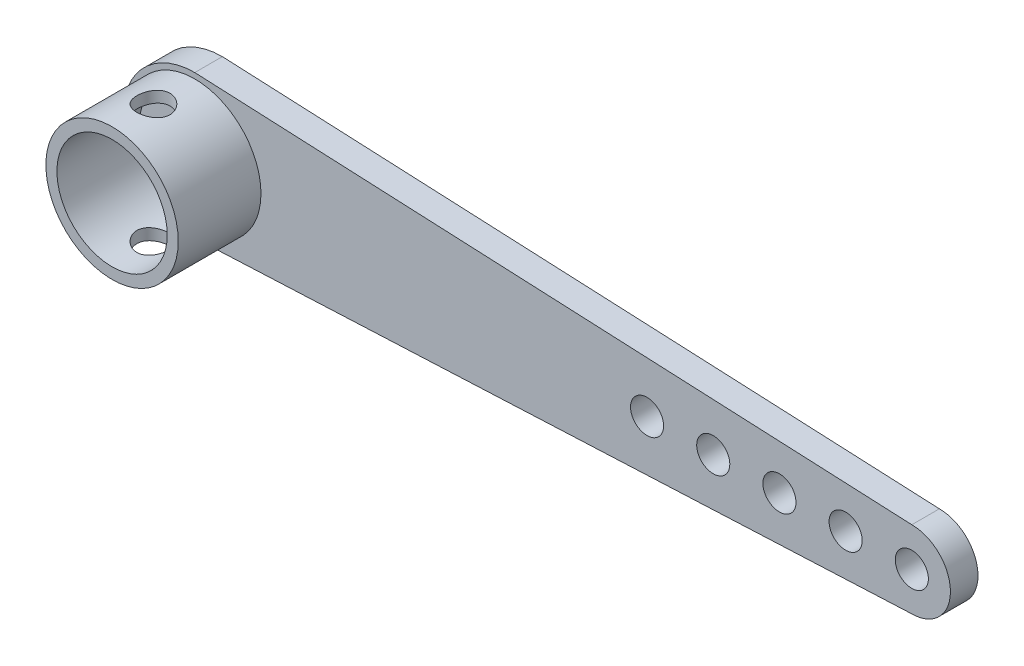
ISO-10303-21;
HEADER;
FILE_DESCRIPTION(('STEP AP214'),'2;1');
FILE_NAME('part.step','',(''),(''),'','','');
FILE_SCHEMA(('AUTOMOTIVE_DESIGN { 1 0 10303 214 1 1 1 1 }'));
ENDSEC;
DATA;
#1=APPLICATION_CONTEXT('core data for automotive mechanical design processes');
#2=APPLICATION_PROTOCOL_DEFINITION('international standard','automotive_design',2000,#1);
#3=PRODUCT_CONTEXT('',#1,'mechanical');
#4=PRODUCT('Part','Part','',(#3));
#5=PRODUCT_RELATED_PRODUCT_CATEGORY('part','',(#4));
#6=PRODUCT_DEFINITION_FORMATION('','',#4);
#7=PRODUCT_DEFINITION_CONTEXT('part definition',#1,'design');
#8=PRODUCT_DEFINITION('design','',#6,#7);
#9=PRODUCT_DEFINITION_SHAPE('','',#8);
#10=(LENGTH_UNIT() NAMED_UNIT(*) SI_UNIT(.MILLI.,.METRE.));
#11=(NAMED_UNIT(*) PLANE_ANGLE_UNIT() SI_UNIT($,.RADIAN.));
#12=(NAMED_UNIT(*) SI_UNIT($,.STERADIAN.) SOLID_ANGLE_UNIT());
#13=UNCERTAINTY_MEASURE_WITH_UNIT(LENGTH_MEASURE(1.E-05),#10,'distance_accuracy_value','');
#14=(GEOMETRIC_REPRESENTATION_CONTEXT(3) GLOBAL_UNCERTAINTY_ASSIGNED_CONTEXT((#13)) GLOBAL_UNIT_ASSIGNED_CONTEXT((#10,
#11,#12)) REPRESENTATION_CONTEXT('',''));
#15=CARTESIAN_POINT('',(0.,0.,0.));
#16=DIRECTION('',(0.,0.,1.));
#17=DIRECTION('',(1.,0.,0.));
#18=AXIS2_PLACEMENT_3D('',#15,#16,#17);
#19=CARTESIAN_POINT('',(0.598724610297591,-12.9723665564478,5.));
#20=DIRECTION('',(-0.0461047666084009,0.998936609848685,0.));
#21=DIRECTION('',(-0.998936609848685,-0.0461047666084009,0.));
#22=AXIS2_PLACEMENT_3D('',#19,#20,#21);
#23=PLANE('',#22);
#24=DIRECTION('',(0.998936609848685,0.0461047666084009,0.));
#25=VECTOR('',#24,1.);
#26=CARTESIAN_POINT('',(0.598724610297591,-12.9723665564478,0.));
#27=LINE('',#26,#25);
#28=CARTESIAN_POINT('',(0.,-13.,0.));
#29=VERTEX_POINT('',#28);
#30=CARTESIAN_POINT('',(130.,-7.,0.));
#31=VERTEX_POINT('',#30);
#32=EDGE_CURVE('E99',#29,#31,#27,.T.);
#33=ORIENTED_EDGE('',*,*,#32,.T.);
#34=DIRECTION('',(0.,0.,-1.));
#35=VECTOR('',#34,1.);
#36=CARTESIAN_POINT('',(130.,-7.,5.));
#37=LINE('',#36,#35);
#38=CARTESIAN_POINT('',(130.,-7.,5.));
#39=VERTEX_POINT('',#38);
#40=EDGE_CURVE('E11',#39,#31,#37,.T.);
#41=ORIENTED_EDGE('',*,*,#40,.F.);
#42=DIRECTION('',(0.998936609848685,0.0461047666084009,0.));
#43=VECTOR('',#42,1.);
#44=CARTESIAN_POINT('',(0.598724610297591,-12.9723665564478,5.));
#45=LINE('',#44,#43);
#46=CARTESIAN_POINT('',(0.,-13.,5.));
#47=VERTEX_POINT('',#46);
#48=EDGE_CURVE('E83',#47,#39,#45,.T.);
#49=ORIENTED_EDGE('',*,*,#48,.F.);
#50=DIRECTION('',(0.,0.,-1.));
#51=VECTOR('',#50,1.);
#52=CARTESIAN_POINT('',(0.,-13.,5.));
#53=LINE('',#52,#51);
#54=EDGE_CURVE('E95',#47,#29,#53,.T.);
#55=ORIENTED_EDGE('',*,*,#54,.T.);
#56=EDGE_LOOP('',(#33,#41,#49,#55));
#57=FACE_BOUND('',#56,.T.);
#58=ADVANCED_FACE('F34',(#57),#23,.F.);
#59=CARTESIAN_POINT('',(130.,0.,5.));
#60=DIRECTION('',(0.,0.,-1.));
#61=DIRECTION('',(-1.,0.,0.));
#62=AXIS2_PLACEMENT_3D('',#59,#60,#61);
#63=CYLINDRICAL_SURFACE('',#62,7.00000000000001);
#64=CARTESIAN_POINT('',(130.,0.,0.));
#65=DIRECTION('',(0.,0.,1.));
#66=DIRECTION('',(1.,0.,0.));
#67=AXIS2_PLACEMENT_3D('',#64,#65,#66);
#68=CIRCLE('',#67,7.00000000000001);
#69=CARTESIAN_POINT('',(130.,7.00000000000001,0.));
#70=VERTEX_POINT('',#69);
#71=EDGE_CURVE('E88',#31,#70,#68,.T.);
#72=ORIENTED_EDGE('',*,*,#71,.T.);
#73=DIRECTION('',(0.,0.,-1.));
#74=VECTOR('',#73,1.);
#75=CARTESIAN_POINT('',(130.,7.00000000000001,5.));
#76=LINE('',#75,#74);
#77=CARTESIAN_POINT('',(130.,7.00000000000001,5.));
#78=VERTEX_POINT('',#77);
#79=EDGE_CURVE('E43',#78,#70,#76,.T.);
#80=ORIENTED_EDGE('',*,*,#79,.F.);
#81=CARTESIAN_POINT('',(130.,0.,5.));
#82=DIRECTION('',(0.,0.,1.));
#83=DIRECTION('',(1.,0.,0.));
#84=AXIS2_PLACEMENT_3D('',#81,#82,#83);
#85=CIRCLE('',#84,7.00000000000001);
#86=EDGE_CURVE('E78',#39,#78,#85,.T.);
#87=ORIENTED_EDGE('',*,*,#86,.F.);
#88=ORIENTED_EDGE('',*,*,#40,.T.);
#89=EDGE_LOOP('',(#72,#80,#87,#88));
#90=FACE_BOUND('',#89,.T.);
#91=ADVANCED_FACE('F87',(#90),#63,.T.);
#92=CARTESIAN_POINT('',(0.598724610297591,12.9723665564478,5.));
#93=DIRECTION('',(0.0461047666084009,0.998936609848685,0.));
#94=DIRECTION('',(-0.998936609848685,0.0461047666084009,0.));
#95=AXIS2_PLACEMENT_3D('',#92,#93,#94);
#96=PLANE('',#95);
#97=DIRECTION('',(0.998936609848685,-0.0461047666084009,0.));
#98=VECTOR('',#97,1.);
#99=CARTESIAN_POINT('',(0.598724610297591,12.9723665564478,0.));
#100=LINE('',#99,#98);
#101=CARTESIAN_POINT('',(0.,13.,0.));
#102=VERTEX_POINT('',#101);
#103=EDGE_CURVE('E104',#102,#70,#100,.T.);
#104=ORIENTED_EDGE('',*,*,#103,.F.);
#105=DIRECTION('',(0.,0.,-1.));
#106=VECTOR('',#105,1.);
#107=CARTESIAN_POINT('',(0.,13.,5.));
#108=LINE('',#107,#106);
#109=CARTESIAN_POINT('',(0.,13.,5.));
#110=VERTEX_POINT('',#109);
#111=EDGE_CURVE('E68',#110,#102,#108,.T.);
#112=ORIENTED_EDGE('',*,*,#111,.F.);
#113=DIRECTION('',(0.998936609848685,-0.0461047666084009,0.));
#114=VECTOR('',#113,1.);
#115=CARTESIAN_POINT('',(0.598724610297591,12.9723665564478,5.));
#116=LINE('',#115,#114);
#117=EDGE_CURVE('E81',#110,#78,#116,.T.);
#118=ORIENTED_EDGE('',*,*,#117,.T.);
#119=ORIENTED_EDGE('',*,*,#79,.T.);
#120=EDGE_LOOP('',(#104,#112,#118,#119));
#121=FACE_BOUND('',#120,.T.);
#122=ADVANCED_FACE('F93',(#121),#96,.T.);
#123=CARTESIAN_POINT('',(0.,0.,5.));
#124=DIRECTION('',(0.,0.,-1.));
#125=DIRECTION('',(-1.,0.,0.));
#126=AXIS2_PLACEMENT_3D('',#123,#124,#125);
#127=CYLINDRICAL_SURFACE('',#126,13.);
#128=CARTESIAN_POINT('',(0.,0.,0.));
#129=DIRECTION('',(0.,0.,1.));
#130=DIRECTION('',(1.,0.,0.));
#131=AXIS2_PLACEMENT_3D('',#128,#129,#130);
#132=CIRCLE('',#131,13.);
#133=EDGE_CURVE('E71',#102,#29,#132,.T.);
#134=ORIENTED_EDGE('',*,*,#133,.T.);
#135=ORIENTED_EDGE('',*,*,#54,.F.);
#136=CARTESIAN_POINT('',(0.,0.,5.));
#137=DIRECTION('',(0.,0.,1.));
#138=DIRECTION('',(1.,0.,0.));
#139=AXIS2_PLACEMENT_3D('',#136,#137,#138);
#140=CIRCLE('',#139,13.);
#141=EDGE_CURVE('E52',#110,#47,#140,.T.);
#142=ORIENTED_EDGE('',*,*,#141,.F.);
#143=ORIENTED_EDGE('',*,*,#111,.T.);
#144=EDGE_LOOP('',(#134,#135,#142,#143));
#145=FACE_BOUND('',#144,.T.);
#146=ADVANCED_FACE('F164',(#145),#127,.T.);
#147=CARTESIAN_POINT('',(0.,0.,5.));
#148=DIRECTION('',(0.,0.,1.));
#149=DIRECTION('',(1.,0.,0.));
#150=AXIS2_PLACEMENT_3D('',#147,#148,#149);
#151=PLANE('',#150);
#152=CARTESIAN_POINT('',(130.,0.,5.));
#153=DIRECTION('',(0.,0.,1.));
#154=DIRECTION('',(1.,0.,0.));
#155=AXIS2_PLACEMENT_3D('',#152,#153,#154);
#156=CIRCLE('',#155,2.99999999999999);
#157=CARTESIAN_POINT('',(133.,0.,5.));
#158=VERTEX_POINT('',#157);
#159=EDGE_CURVE('E339',#158,#158,#156,.T.);
#160=ORIENTED_EDGE('',*,*,#159,.F.);
#161=EDGE_LOOP('',(#160));
#162=FACE_BOUND('',#161,.T.);
#163=CARTESIAN_POINT('',(118.,0.,5.));
#164=DIRECTION('',(0.,0.,1.));
#165=DIRECTION('',(1.,0.,0.));
#166=AXIS2_PLACEMENT_3D('',#163,#164,#165);
#167=CIRCLE('',#166,3.00000000000001);
#168=CARTESIAN_POINT('',(121.,0.,5.));
#169=VERTEX_POINT('',#168);
#170=EDGE_CURVE('E356',#169,#169,#167,.T.);
#171=ORIENTED_EDGE('',*,*,#170,.F.);
#172=EDGE_LOOP('',(#171));
#173=FACE_BOUND('',#172,.T.);
#174=CARTESIAN_POINT('',(106.,0.,5.));
#175=DIRECTION('',(0.,0.,1.));
#176=DIRECTION('',(1.,0.,0.));
#177=AXIS2_PLACEMENT_3D('',#174,#175,#176);
#178=CIRCLE('',#177,3.00000000000001);
#179=CARTESIAN_POINT('',(109.,0.,5.));
#180=VERTEX_POINT('',#179);
#181=EDGE_CURVE('E359',#180,#180,#178,.T.);
#182=ORIENTED_EDGE('',*,*,#181,.F.);
#183=EDGE_LOOP('',(#182));
#184=FACE_BOUND('',#183,.T.);
#185=CARTESIAN_POINT('',(94.,0.,5.));
#186=DIRECTION('',(0.,0.,1.));
#187=DIRECTION('',(1.,0.,0.));
#188=AXIS2_PLACEMENT_3D('',#185,#186,#187);
#189=CIRCLE('',#188,3.00000000000001);
#190=CARTESIAN_POINT('',(97.,0.,5.));
#191=VERTEX_POINT('',#190);
#192=EDGE_CURVE('E363',#191,#191,#189,.T.);
#193=ORIENTED_EDGE('',*,*,#192,.F.);
#194=EDGE_LOOP('',(#193));
#195=FACE_BOUND('',#194,.T.);
#196=CARTESIAN_POINT('',(82.,0.,5.));
#197=DIRECTION('',(0.,0.,1.));
#198=DIRECTION('',(1.,0.,0.));
#199=AXIS2_PLACEMENT_3D('',#196,#197,#198);
#200=CIRCLE('',#199,3.00000000000001);
#201=CARTESIAN_POINT('',(85.,0.,5.));
#202=VERTEX_POINT('',#201);
#203=EDGE_CURVE('E148',#202,#202,#200,.T.);
#204=ORIENTED_EDGE('',*,*,#203,.F.);
#205=EDGE_LOOP('',(#204));
#206=FACE_BOUND('',#205,.T.);
#207=CARTESIAN_POINT('',(0.,0.,5.));
#208=DIRECTION('',(0.,0.,1.));
#209=DIRECTION('',(1.,0.,0.));
#210=AXIS2_PLACEMENT_3D('',#207,#208,#209);
#211=CIRCLE('',#210,12.);
#212=CARTESIAN_POINT('',(12.,0.,5.));
#213=VERTEX_POINT('',#212);
#214=EDGE_CURVE('E182',#213,#213,#211,.T.);
#215=ORIENTED_EDGE('',*,*,#214,.F.);
#216=EDGE_LOOP('',(#215));
#217=FACE_BOUND('',#216,.T.);
#218=ORIENTED_EDGE('',*,*,#48,.T.);
#219=ORIENTED_EDGE('',*,*,#86,.T.);
#220=ORIENTED_EDGE('',*,*,#117,.F.);
#221=ORIENTED_EDGE('',*,*,#141,.T.);
#222=EDGE_LOOP('',(#218,#219,#220,#221));
#223=FACE_BOUND('',#222,.T.);
#224=ADVANCED_FACE('F79',(#162,#173,#184,#195,#206,#217,#223),#151,.T.);
#225=CARTESIAN_POINT('',(0.,0.,0.));
#226=DIRECTION('',(0.,0.,1.));
#227=DIRECTION('',(1.,0.,0.));
#228=AXIS2_PLACEMENT_3D('',#225,#226,#227);
#229=PLANE('',#228);
#230=CARTESIAN_POINT('',(130.,0.,0.));
#231=DIRECTION('',(0.,0.,1.));
#232=DIRECTION('',(1.,0.,0.));
#233=AXIS2_PLACEMENT_3D('',#230,#231,#232);
#234=CIRCLE('',#233,2.99999999999999);
#235=CARTESIAN_POINT('',(133.,0.,0.));
#236=VERTEX_POINT('',#235);
#237=EDGE_CURVE('E37',#236,#236,#234,.T.);
#238=ORIENTED_EDGE('',*,*,#237,.T.);
#239=EDGE_LOOP('',(#238));
#240=FACE_BOUND('',#239,.T.);
#241=CARTESIAN_POINT('',(118.,0.,0.));
#242=DIRECTION('',(0.,0.,1.));
#243=DIRECTION('',(1.,0.,0.));
#244=AXIS2_PLACEMENT_3D('',#241,#242,#243);
#245=CIRCLE('',#244,3.00000000000001);
#246=CARTESIAN_POINT('',(121.,0.,0.));
#247=VERTEX_POINT('',#246);
#248=EDGE_CURVE('E342',#247,#247,#245,.T.);
#249=ORIENTED_EDGE('',*,*,#248,.T.);
#250=EDGE_LOOP('',(#249));
#251=FACE_BOUND('',#250,.T.);
#252=CARTESIAN_POINT('',(106.,0.,0.));
#253=DIRECTION('',(0.,0.,1.));
#254=DIRECTION('',(1.,0.,0.));
#255=AXIS2_PLACEMENT_3D('',#252,#253,#254);
#256=CIRCLE('',#255,3.00000000000001);
#257=CARTESIAN_POINT('',(109.,0.,0.));
#258=VERTEX_POINT('',#257);
#259=EDGE_CURVE('E344',#258,#258,#256,.T.);
#260=ORIENTED_EDGE('',*,*,#259,.T.);
#261=EDGE_LOOP('',(#260));
#262=FACE_BOUND('',#261,.T.);
#263=CARTESIAN_POINT('',(94.,0.,0.));
#264=DIRECTION('',(0.,0.,1.));
#265=DIRECTION('',(1.,0.,0.));
#266=AXIS2_PLACEMENT_3D('',#263,#264,#265);
#267=CIRCLE('',#266,3.00000000000001);
#268=CARTESIAN_POINT('',(97.,0.,0.));
#269=VERTEX_POINT('',#268);
#270=EDGE_CURVE('E348',#269,#269,#267,.T.);
#271=ORIENTED_EDGE('',*,*,#270,.T.);
#272=EDGE_LOOP('',(#271));
#273=FACE_BOUND('',#272,.T.);
#274=CARTESIAN_POINT('',(82.,0.,0.));
#275=DIRECTION('',(0.,0.,1.));
#276=DIRECTION('',(1.,0.,0.));
#277=AXIS2_PLACEMENT_3D('',#274,#275,#276);
#278=CIRCLE('',#277,3.00000000000001);
#279=CARTESIAN_POINT('',(85.,0.,0.));
#280=VERTEX_POINT('',#279);
#281=EDGE_CURVE('E352',#280,#280,#278,.T.);
#282=ORIENTED_EDGE('',*,*,#281,.T.);
#283=EDGE_LOOP('',(#282));
#284=FACE_BOUND('',#283,.T.);
#285=ORIENTED_EDGE('',*,*,#32,.F.);
#286=ORIENTED_EDGE('',*,*,#133,.F.);
#287=ORIENTED_EDGE('',*,*,#103,.T.);
#288=ORIENTED_EDGE('',*,*,#71,.F.);
#289=EDGE_LOOP('',(#285,#286,#287,#288));
#290=FACE_BOUND('',#289,.T.);
#291=ADVANCED_FACE('F159',(#240,#251,#262,#273,#284,#290),#229,.F.);
#292=CARTESIAN_POINT('',(0.,0.,20.));
#293=DIRECTION('',(0.,0.,-1.));
#294=DIRECTION('',(-1.,0.,0.));
#295=AXIS2_PLACEMENT_3D('',#292,#293,#294);
#296=CYLINDRICAL_SURFACE('',#295,12.);
#297=CARTESIAN_POINT('',(0.,-12.,15.5));
#298=CARTESIAN_POINT('',(0.165752177339462,-11.9999971973602,15.4999953485237));
#299=CARTESIAN_POINT('',(0.331556315661526,-11.9965315626365,15.4862168984524));
#300=CARTESIAN_POINT('',(0.658412647541065,-11.9830422765979,15.431549697386));
#301=CARTESIAN_POINT('',(0.819462093741479,-11.9730149083995,15.3906455809243));
#302=CARTESIAN_POINT('',(1.13204174436515,-11.9475125266406,15.2831214930758));
#303=CARTESIAN_POINT('',(1.28358312686,-11.9320440568412,15.2165324025695));
#304=CARTESIAN_POINT('',(1.57334426380886,-11.8973068761524,15.0596372199103));
#305=CARTESIAN_POINT('',(1.71156356869753,-11.8780380370831,14.9693303277621));
#306=CARTESIAN_POINT('',(1.97360385460183,-11.8373482718339,14.7655984206916));
#307=CARTESIAN_POINT('',(2.09711138012211,-11.8158941429625,14.6517768500819));
#308=CARTESIAN_POINT('',(2.32349785440664,-11.7734724023587,14.4050955901819));
#309=CARTESIAN_POINT('',(2.42637447389838,-11.7525048457974,14.2722337541061));
#310=CARTESIAN_POINT('',(2.61005308559795,-11.7130955139634,13.988809546526));
#311=CARTESIAN_POINT('',(2.69050443185028,-11.6946958892962,13.8380135383825));
#312=CARTESIAN_POINT('',(2.82479381710149,-11.6629898963603,13.5245031766799));
#313=CARTESIAN_POINT('',(2.87863611088028,-11.6496827138884,13.361790733336));
#314=CARTESIAN_POINT('',(2.95710967360953,-11.6300095339265,13.0325130035967));
#315=CARTESIAN_POINT('',(2.98230453666411,-11.6235098199402,12.866090207924));
#316=CARTESIAN_POINT('',(3.00452355013282,-11.6177872491918,12.5312628620013));
#317=CARTESIAN_POINT('',(3.00155228363622,-11.6185632085586,12.3628586386157));
#318=CARTESIAN_POINT('',(2.96797304927941,-11.6271841103363,12.0331683845093));
#319=CARTESIAN_POINT('',(2.93803668038127,-11.6348572601459,11.8718087570693));
#320=CARTESIAN_POINT('',(2.85244837380599,-11.6561341934214,11.5564778981779));
#321=CARTESIAN_POINT('',(2.79679460413879,-11.6697383993848,11.4025071939422));
#322=CARTESIAN_POINT('',(2.66077895587437,-11.7015022781132,11.1045239674957));
#323=CARTESIAN_POINT('',(2.58017333446584,-11.7197065493963,10.9606276564209));
#324=CARTESIAN_POINT('',(2.39671255202989,-11.7585942169198,10.6881625804864));
#325=CARTESIAN_POINT('',(2.29385349761767,-11.7792780466926,10.5595965038655));
#326=CARTESIAN_POINT('',(2.06532684936244,-11.8215176107978,10.3175927686112));
#327=CARTESIAN_POINT('',(1.93909251633172,-11.84308138956,10.2046910198773));
#328=CARTESIAN_POINT('',(1.6692238350074,-11.8841193115751,10.0015575150722));
#329=CARTESIAN_POINT('',(1.52558895541589,-11.9035933909882,9.91132645147287));
#330=CARTESIAN_POINT('',(1.22423177736278,-11.9383546418838,9.75589882755123));
#331=CARTESIAN_POINT('',(1.06646278641725,-11.9536272025545,9.69078931949114));
#332=CARTESIAN_POINT('',(0.741752016285765,-11.9781583398283,9.58816538858085));
#333=CARTESIAN_POINT('',(0.574811998300968,-11.9874180667856,9.55064568716372));
#334=CARTESIAN_POINT('',(0.241079940780053,-11.9987099854275,9.50508486888232));
#335=CARTESIAN_POINT('',(0.0743934399764201,-12.0009210701655,9.4963139478494));
#336=CARTESIAN_POINT('',(-0.258065749603017,-11.998376096289,9.50649800411098));
#337=CARTESIAN_POINT('',(-0.423838519289193,-11.9936206648371,9.52545048559827));
#338=CARTESIAN_POINT('',(-0.747228537552981,-11.977791622547,9.58994181678275));
#339=CARTESIAN_POINT('',(-0.9049302379375,-11.9668126837158,9.63508252695395));
#340=CARTESIAN_POINT('',(-1.21051458490503,-11.9397741326831,9.75021416805692));
#341=CARTESIAN_POINT('',(-1.3583962380653,-11.9237140073996,9.82020760862644));
#342=CARTESIAN_POINT('',(-1.64304626885966,-11.8878661585244,9.98447225774935));
#343=CARTESIAN_POINT('',(-1.77957088367153,-11.868017347332,10.0791522247931));
#344=CARTESIAN_POINT('',(-2.03505322728662,-11.826890183755,10.2895798175943));
#345=CARTESIAN_POINT('',(-2.1540079179465,-11.8056115850589,10.4053310792353));
#346=CARTESIAN_POINT('',(-2.37398113614497,-11.76337913919,10.6580039216874));
#347=CARTESIAN_POINT('',(-2.47448773524221,-11.7424460836496,10.7953754059991));
#348=CARTESIAN_POINT('',(-2.65102151802725,-11.7038575676408,11.0854652689372));
#349=CARTESIAN_POINT('',(-2.72704978832281,-11.6862019616993,11.2381829659409));
#350=CARTESIAN_POINT('',(-2.85190284121468,-11.656361894336,11.5538114448125));
#351=CARTESIAN_POINT('',(-2.90088879328717,-11.6441451045097,11.7166552566246));
#352=CARTESIAN_POINT('',(-2.97069131988587,-11.626534880479,12.0486192757106));
#353=CARTESIAN_POINT('',(-2.99151405495183,-11.6211399540485,12.2177381020429));
#354=CARTESIAN_POINT('',(-3.004077180673,-11.6178980244194,12.5522420477232));
#355=CARTESIAN_POINT('',(-2.99663579556158,-11.6198386546564,12.7175948702529));
#356=CARTESIAN_POINT('',(-2.95475455662439,-11.6305581800657,13.0446077773325));
#357=CARTESIAN_POINT('',(-2.92031524537318,-11.6393369378128,13.2062679360264));
#358=CARTESIAN_POINT('',(-2.82586263888595,-11.6626252136787,13.5204169181317));
#359=CARTESIAN_POINT('',(-2.76600280936085,-11.6771003047327,13.6729546104807));
#360=CARTESIAN_POINT('',(-2.62252982721005,-11.7101551144901,13.9659307654271));
#361=CARTESIAN_POINT('',(-2.53891338006835,-11.7287354024137,14.1063675463738));
#362=CARTESIAN_POINT('',(-2.3477354972743,-11.7685126852721,14.3751092580041));
#363=CARTESIAN_POINT('',(-2.23960632582452,-11.7897652966356,14.5030021468479));
#364=CARTESIAN_POINT('',(-2.00357874237946,-11.8321605449252,14.7390940895908));
#365=CARTESIAN_POINT('',(-1.87567564252229,-11.8533031545411,14.8472884602259));
#366=CARTESIAN_POINT('',(-1.60093517340518,-11.8935531129534,15.0428226171292));
#367=CARTESIAN_POINT('',(-1.45379684463277,-11.9126166673174,15.1297492273432));
#368=CARTESIAN_POINT('',(-1.14653211902095,-11.9460984995023,15.2774949258811));
#369=CARTESIAN_POINT('',(-0.986415126873479,-11.9605201039956,15.3383327212971));
#370=CARTESIAN_POINT('',(-0.688820506486943,-11.9809611913108,15.4231436606593));
#371=CARTESIAN_POINT('',(-0.552760341816137,-11.9880517010538,15.4519024861069));
#372=CARTESIAN_POINT('',(-0.277812143072566,-11.997572104639,15.4903318872439));
#373=CARTESIAN_POINT('',(-0.138924322485232,-12.0000023490179,15.5000038986106));
#374=CARTESIAN_POINT('',(0.,-12.,15.5));
#375=B_SPLINE_CURVE_WITH_KNOTS('',3,(#297,#298,#299,#300,#301,#302,#303,#304,#305,#306,#307,
#308,#309,#310,#311,#312,#313,#314,#315,#316,#317,#318,#319,#320,#321,#322,#323,#324,#325,#326,
#327,#328,#329,#330,#331,#332,#333,#334,#335,#336,#337,#338,#339,#340,#341,#342,#343,#344,#345,
#346,#347,#348,#349,#350,#351,#352,#353,#354,#355,#356,#357,#358,#359,#360,#361,#362,#363,#364,
#365,#366,#367,#368,#369,#370,#371,#372,#373,#374),.UNSPECIFIED.,.T.,.F.,(4,2,2,2,2,2,2,2,2,2,2,
2,2,2,2,2,2,2,2,2,2,2,2,2,2,2,2,2,2,2,2,2,2,2,2,2,2,2,4),(0.,0.496747424943779,0.9937764755278,
1.49020980457221,1.98665988033866,2.49228870874278,2.99797459160124,3.51117295091613,
4.02428922338737,4.5271259020214,5.02988076232035,5.52044994020678,6.01105406938718,
6.506610557544,7.00225381678967,7.5120300194468,8.02182179123136,8.5333645802487,
9.04480947383927,9.54316617905194,10.0414780223213,10.5324054903472,11.0233825465122,
11.5230717513735,12.0228472602268,12.5348901841559,13.0469103750566,13.5558450923716,
14.0646684651657,14.5588756080898,15.0530728192382,15.5443280113065,16.0356513628556,
16.5397915283158,17.0440513955259,17.5574437101093,18.0704672765446,18.4868448589605,
18.9031911209784),.UNSPECIFIED.);
#376=CARTESIAN_POINT('',(0.,-12.,15.5));
#377=VERTEX_POINT('',#376);
#378=EDGE_CURVE('E147',#377,#377,#375,.T.);
#379=ORIENTED_EDGE('',*,*,#378,.T.);
#380=EDGE_LOOP('',(#379));
#381=FACE_BOUND('',#380,.T.);
#382=CARTESIAN_POINT('',(0.,12.,15.5));
#383=CARTESIAN_POINT('',(-0.165752177339462,11.9999971973602,15.4999953485237));
#384=CARTESIAN_POINT('',(-0.331556315661526,11.9965315626365,15.4862168984524));
#385=CARTESIAN_POINT('',(-0.658412647541065,11.9830422765979,15.431549697386));
#386=CARTESIAN_POINT('',(-0.819462093741479,11.9730149083995,15.3906455809243));
#387=CARTESIAN_POINT('',(-1.13204174436515,11.9475125266406,15.2831214930758));
#388=CARTESIAN_POINT('',(-1.28358312686,11.9320440568412,15.2165324025695));
#389=CARTESIAN_POINT('',(-1.57334426380886,11.8973068761524,15.0596372199103));
#390=CARTESIAN_POINT('',(-1.71156356869753,11.8780380370831,14.9693303277621));
#391=CARTESIAN_POINT('',(-1.97360385460183,11.8373482718339,14.7655984206916));
#392=CARTESIAN_POINT('',(-2.09711138012211,11.8158941429625,14.6517768500819));
#393=CARTESIAN_POINT('',(-2.32349785440664,11.7734724023587,14.4050955901819));
#394=CARTESIAN_POINT('',(-2.42637447389838,11.7525048457974,14.2722337541061));
#395=CARTESIAN_POINT('',(-2.61005308559795,11.7130955139634,13.988809546526));
#396=CARTESIAN_POINT('',(-2.69050443185028,11.6946958892962,13.8380135383825));
#397=CARTESIAN_POINT('',(-2.82479381710149,11.6629898963603,13.5245031766799));
#398=CARTESIAN_POINT('',(-2.87863611088028,11.6496827138884,13.361790733336));
#399=CARTESIAN_POINT('',(-2.95710967360953,11.6300095339265,13.0325130035967));
#400=CARTESIAN_POINT('',(-2.98230453666411,11.6235098199402,12.866090207924));
#401=CARTESIAN_POINT('',(-3.00452355013282,11.6177872491918,12.5312628620013));
#402=CARTESIAN_POINT('',(-3.00155228363622,11.6185632085586,12.3628586386157));
#403=CARTESIAN_POINT('',(-2.96797304927941,11.6271841103363,12.0331683845093));
#404=CARTESIAN_POINT('',(-2.93803668038127,11.6348572601459,11.8718087570693));
#405=CARTESIAN_POINT('',(-2.85244837380599,11.6561341934214,11.5564778981779));
#406=CARTESIAN_POINT('',(-2.79679460413879,11.6697383993848,11.4025071939422));
#407=CARTESIAN_POINT('',(-2.66077895587437,11.7015022781132,11.1045239674957));
#408=CARTESIAN_POINT('',(-2.58017333446584,11.7197065493963,10.9606276564209));
#409=CARTESIAN_POINT('',(-2.39671255202989,11.7585942169198,10.6881625804864));
#410=CARTESIAN_POINT('',(-2.29385349761767,11.7792780466926,10.5595965038655));
#411=CARTESIAN_POINT('',(-2.06532684936244,11.8215176107978,10.3175927686112));
#412=CARTESIAN_POINT('',(-1.93909251633172,11.84308138956,10.2046910198773));
#413=CARTESIAN_POINT('',(-1.6692238350074,11.8841193115751,10.0015575150722));
#414=CARTESIAN_POINT('',(-1.52558895541589,11.9035933909882,9.91132645147287));
#415=CARTESIAN_POINT('',(-1.22423177736278,11.9383546418838,9.75589882755123));
#416=CARTESIAN_POINT('',(-1.06646278641725,11.9536272025545,9.69078931949114));
#417=CARTESIAN_POINT('',(-0.741752016285765,11.9781583398283,9.58816538858085));
#418=CARTESIAN_POINT('',(-0.574811998300968,11.9874180667856,9.55064568716372));
#419=CARTESIAN_POINT('',(-0.241079940780053,11.9987099854275,9.50508486888232));
#420=CARTESIAN_POINT('',(-0.0743934399764201,12.0009210701655,9.4963139478494));
#421=CARTESIAN_POINT('',(0.258065749603017,11.998376096289,9.50649800411098));
#422=CARTESIAN_POINT('',(0.423838519289193,11.9936206648371,9.52545048559827));
#423=CARTESIAN_POINT('',(0.747228537552981,11.977791622547,9.58994181678275));
#424=CARTESIAN_POINT('',(0.9049302379375,11.9668126837158,9.63508252695395));
#425=CARTESIAN_POINT('',(1.21051458490503,11.9397741326831,9.75021416805692));
#426=CARTESIAN_POINT('',(1.3583962380653,11.9237140073996,9.82020760862644));
#427=CARTESIAN_POINT('',(1.64304626885966,11.8878661585244,9.98447225774935));
#428=CARTESIAN_POINT('',(1.77957088367153,11.868017347332,10.0791522247931));
#429=CARTESIAN_POINT('',(2.03505322728662,11.826890183755,10.2895798175943));
#430=CARTESIAN_POINT('',(2.1540079179465,11.8056115850589,10.4053310792353));
#431=CARTESIAN_POINT('',(2.37398113614497,11.76337913919,10.6580039216874));
#432=CARTESIAN_POINT('',(2.47448773524221,11.7424460836496,10.7953754059991));
#433=CARTESIAN_POINT('',(2.65102151802725,11.7038575676408,11.0854652689372));
#434=CARTESIAN_POINT('',(2.72704978832281,11.6862019616993,11.2381829659409));
#435=CARTESIAN_POINT('',(2.85190284121468,11.656361894336,11.5538114448125));
#436=CARTESIAN_POINT('',(2.90088879328717,11.6441451045097,11.7166552566246));
#437=CARTESIAN_POINT('',(2.97069131988587,11.626534880479,12.0486192757106));
#438=CARTESIAN_POINT('',(2.99151405495183,11.6211399540485,12.2177381020429));
#439=CARTESIAN_POINT('',(3.004077180673,11.6178980244194,12.5522420477232));
#440=CARTESIAN_POINT('',(2.99663579556158,11.6198386546564,12.7175948702529));
#441=CARTESIAN_POINT('',(2.95475455662439,11.6305581800657,13.0446077773325));
#442=CARTESIAN_POINT('',(2.92031524537318,11.6393369378128,13.2062679360264));
#443=CARTESIAN_POINT('',(2.82586263888595,11.6626252136787,13.5204169181317));
#444=CARTESIAN_POINT('',(2.76600280936085,11.6771003047327,13.6729546104807));
#445=CARTESIAN_POINT('',(2.62252982721005,11.7101551144901,13.9659307654271));
#446=CARTESIAN_POINT('',(2.53891338006835,11.7287354024137,14.1063675463738));
#447=CARTESIAN_POINT('',(2.3477354972743,11.7685126852721,14.3751092580041));
#448=CARTESIAN_POINT('',(2.23960632582452,11.7897652966356,14.5030021468479));
#449=CARTESIAN_POINT('',(2.00357874237946,11.8321605449252,14.7390940895908));
#450=CARTESIAN_POINT('',(1.87567564252229,11.8533031545411,14.8472884602259));
#451=CARTESIAN_POINT('',(1.60093517340518,11.8935531129534,15.0428226171292));
#452=CARTESIAN_POINT('',(1.45379684463277,11.9126166673174,15.1297492273432));
#453=CARTESIAN_POINT('',(1.14653211902095,11.9460984995023,15.2774949258811));
#454=CARTESIAN_POINT('',(0.986415126873479,11.9605201039956,15.3383327212971));
#455=CARTESIAN_POINT('',(0.688820506486943,11.9809611913108,15.4231436606593));
#456=CARTESIAN_POINT('',(0.552760341816137,11.9880517010538,15.4519024861069));
#457=CARTESIAN_POINT('',(0.277812143072566,11.997572104639,15.4903318872439));
#458=CARTESIAN_POINT('',(0.138924322485232,12.0000023490179,15.5000038986106));
#459=CARTESIAN_POINT('',(0.,12.,15.5));
#460=B_SPLINE_CURVE_WITH_KNOTS('',3,(#382,#383,#384,#385,#386,#387,#388,#389,#390,#391,#392,
#393,#394,#395,#396,#397,#398,#399,#400,#401,#402,#403,#404,#405,#406,#407,#408,#409,#410,#411,
#412,#413,#414,#415,#416,#417,#418,#419,#420,#421,#422,#423,#424,#425,#426,#427,#428,#429,#430,
#431,#432,#433,#434,#435,#436,#437,#438,#439,#440,#441,#442,#443,#444,#445,#446,#447,#448,#449,
#450,#451,#452,#453,#454,#455,#456,#457,#458,#459),.UNSPECIFIED.,.T.,.F.,(4,2,2,2,2,2,2,2,2,2,2,
2,2,2,2,2,2,2,2,2,2,2,2,2,2,2,2,2,2,2,2,2,2,2,2,2,2,2,4),(0.,0.496747424943779,0.9937764755278,
1.49020980457221,1.98665988033866,2.49228870874278,2.99797459160124,3.51117295091613,
4.02428922338737,4.5271259020214,5.02988076232035,5.52044994020678,6.01105406938718,
6.506610557544,7.00225381678967,7.5120300194468,8.02182179123136,8.5333645802487,
9.04480947383927,9.54316617905194,10.0414780223213,10.5324054903472,11.0233825465122,
11.5230717513735,12.0228472602268,12.5348901841559,13.0469103750566,13.5558450923716,
14.0646684651657,14.5588756080898,15.0530728192382,15.5443280113065,16.0356513628556,
16.5397915283158,17.0440513955259,17.5574437101093,18.0704672765446,18.4868448589605,
18.9031911209784),.UNSPECIFIED.);
#461=CARTESIAN_POINT('',(0.,12.,15.5));
#462=VERTEX_POINT('',#461);
#463=EDGE_CURVE('E140',#462,#462,#460,.T.);
#464=ORIENTED_EDGE('',*,*,#463,.T.);
#465=EDGE_LOOP('',(#464));
#466=FACE_BOUND('',#465,.T.);
#467=CARTESIAN_POINT('',(0.,0.,20.));
#468=DIRECTION('',(0.,0.,1.));
#469=DIRECTION('',(1.,0.,0.));
#470=AXIS2_PLACEMENT_3D('',#467,#468,#469);
#471=CIRCLE('',#470,12.);
#472=CARTESIAN_POINT('',(12.,0.,20.));
#473=VERTEX_POINT('',#472);
#474=EDGE_CURVE('E102',#473,#473,#471,.T.);
#475=ORIENTED_EDGE('',*,*,#474,.F.);
#476=EDGE_LOOP('',(#475));
#477=FACE_BOUND('',#476,.T.);
#478=ORIENTED_EDGE('',*,*,#214,.T.);
#479=EDGE_LOOP('',(#478));
#480=FACE_BOUND('',#479,.T.);
#481=ADVANCED_FACE('F154',(#381,#466,#477,#480),#296,.T.);
#482=CARTESIAN_POINT('',(0.,0.,20.));
#483=DIRECTION('',(0.,0.,1.));
#484=DIRECTION('',(1.,0.,0.));
#485=AXIS2_PLACEMENT_3D('',#482,#483,#484);
#486=PLANE('',#485);
#487=CARTESIAN_POINT('',(0.,0.,20.));
#488=DIRECTION('',(0.,0.,1.));
#489=DIRECTION('',(1.,0.,0.));
#490=AXIS2_PLACEMENT_3D('',#487,#488,#489);
#491=CIRCLE('',#490,10.);
#492=CARTESIAN_POINT('',(10.,0.,20.));
#493=VERTEX_POINT('',#492);
#494=EDGE_CURVE('E188',#493,#493,#491,.T.);
#495=ORIENTED_EDGE('',*,*,#494,.F.);
#496=EDGE_LOOP('',(#495));
#497=FACE_BOUND('',#496,.T.);
#498=ORIENTED_EDGE('',*,*,#474,.T.);
#499=EDGE_LOOP('',(#498));
#500=FACE_BOUND('',#499,.T.);
#501=ADVANCED_FACE('F158',(#497,#500),#486,.T.);
#502=CARTESIAN_POINT('',(0.,0.,5.));
#503=DIRECTION('',(0.,0.,1.));
#504=DIRECTION('',(1.,0.,0.));
#505=AXIS2_PLACEMENT_3D('',#502,#503,#504);
#506=CYLINDRICAL_SURFACE('',#505,10.);
#507=CARTESIAN_POINT('',(0.,-10.,15.5));
#508=CARTESIAN_POINT('',(-0.1645772255066,-9.99999858501101,15.4999980050302));
#509=CARTESIAN_POINT('',(-0.329174636703059,-9.99589831387907,15.4864122727521));
#510=CARTESIAN_POINT('',(-0.653576250609762,-9.97994211187382,15.4325572915558));
#511=CARTESIAN_POINT('',(-0.81337900882284,-9.96808386779384,15.3922800839533));
#512=CARTESIAN_POINT('',(-1.12346541550905,-9.93791105003673,15.2865079661795));
#513=CARTESIAN_POINT('',(-1.27376272879075,-9.91960600500851,15.2210502607621));
#514=CARTESIAN_POINT('',(-1.56124836210626,-9.87844218475291,15.0669278138883));
#515=CARTESIAN_POINT('',(-1.69843493493934,-9.85558280384133,14.9782599852092));
#516=CARTESIAN_POINT('',(-1.95974359436749,-9.80701474385548,14.7775519850547));
#517=CARTESIAN_POINT('',(-2.08343614248868,-9.78124767314073,14.6649667482282));
#518=CARTESIAN_POINT('',(-2.31049841846647,-9.73011668420884,14.4207815401796));
#519=CARTESIAN_POINT('',(-2.41386472654882,-9.70475283449003,14.2891783757501));
#520=CARTESIAN_POINT('',(-2.59960075447415,-9.65668227987544,14.0070584939248));
#521=CARTESIAN_POINT('',(-2.68144618044427,-9.63404813327749,13.8561830780185));
#522=CARTESIAN_POINT('',(-2.81842789549521,-9.59487240788062,13.5420214915394));
#523=CARTESIAN_POINT('',(-2.87357059839947,-9.57832936626621,13.378738312144));
#524=CARTESIAN_POINT('',(-2.95403267365303,-9.55381741676868,13.0492194677391));
#525=CARTESIAN_POINT('',(-2.98014392469355,-9.54562138649067,12.8831945122721));
#526=CARTESIAN_POINT('',(-3.00427461229344,-9.53805579499534,12.5489336875665));
#527=CARTESIAN_POINT('',(-3.00230085522157,-9.53868409521142,12.3806983638818));
#528=CARTESIAN_POINT('',(-2.97093954399623,-9.54849488135555,12.053232182783));
#529=CARTESIAN_POINT('',(-2.9425441052537,-9.55736777198281,11.8938954992755));
#530=CARTESIAN_POINT('',(-2.86074840854112,-9.58216712457248,11.5823604274531));
#531=CARTESIAN_POINT('',(-2.80734568283282,-9.59809428264701,11.4301627452513));
#532=CARTESIAN_POINT('',(-2.67632053307363,-9.63545466149946,11.1347993006785));
#533=CARTESIAN_POINT('',(-2.59837633869285,-9.65696032231904,10.9917858320895));
#534=CARTESIAN_POINT('',(-2.42070445177367,-9.70301974000129,10.7205359559796));
#535=CARTESIAN_POINT('',(-2.32097148005177,-9.72757423493982,10.5923031411724));
#536=CARTESIAN_POINT('',(-2.09762581531093,-9.77822022595875,10.348627618476));
#537=CARTESIAN_POINT('',(-1.97318981493394,-9.80433308620996,10.2339426719407));
#538=CARTESIAN_POINT('',(-1.70652651862793,-9.85424488126517,10.0268920318715));
#539=CARTESIAN_POINT('',(-1.56429810372178,-9.8780436703682,9.93452774317115));
#540=CARTESIAN_POINT('',(-1.26471007668561,-9.92086320138941,9.77428015507054));
#541=CARTESIAN_POINT('',(-1.1072554994959,-9.93985087336628,9.70656496750028));
#542=CARTESIAN_POINT('',(-0.782490831207039,-9.97067043664444,9.59880081980074));
#543=CARTESIAN_POINT('',(-0.615183503179163,-9.98250432373999,9.55874414293502));
#544=CARTESIAN_POINT('',(-0.281904485336663,-9.99736729287077,9.50869564420121));
#545=CARTESIAN_POINT('',(-0.116100195202374,-10.0006970083558,9.49767682839678));
#546=CARTESIAN_POINT('',(0.214999211646766,-9.99905846483519,9.50313831142416));
#547=CARTESIAN_POINT('',(0.380294393381561,-9.99409131355514,9.51961493930289));
#548=CARTESIAN_POINT('',(0.701807210619394,-9.97661393974325,9.57876922222299));
#549=CARTESIAN_POINT('',(0.858145545228339,-9.96427659598829,9.62084677516174));
#550=CARTESIAN_POINT('',(1.16150927790904,-9.9334869568307,9.7292864655564));
#551=CARTESIAN_POINT('',(1.30853355405117,-9.91503392642188,9.79565152207572));
#552=CARTESIAN_POINT('',(1.5928743789221,-9.87339308702631,9.95250633096227));
#553=CARTESIAN_POINT('',(1.72988765239933,-9.8501056165928,10.043518681896));
#554=CARTESIAN_POINT('',(1.9870466159603,-9.80146937528705,10.2464495081056));
#555=CARTESIAN_POINT('',(2.10718806471188,-9.7761200886242,10.3583732237753));
#556=CARTESIAN_POINT('',(2.33171489102052,-9.72506343738007,10.6047746167387));
#557=CARTESIAN_POINT('',(2.43536962463001,-9.69937650065513,10.7399237515437));
#558=CARTESIAN_POINT('',(2.61857990144313,-9.65153030477949,11.0262558780269));
#559=CARTESIAN_POINT('',(2.69813607658965,-9.62937095313121,11.1774384491158));
#560=CARTESIAN_POINT('',(2.83034694254316,-9.5913437922631,11.49106498251));
#561=CARTESIAN_POINT('',(2.88312693874022,-9.57544675673501,11.6534523730757));
#562=CARTESIAN_POINT('',(2.96043461630306,-9.55183188739737,11.9853759378605));
#563=CARTESIAN_POINT('',(2.98497197957849,-9.54411125069387,12.1549096415661));
#564=CARTESIAN_POINT('',(3.0044396896993,-9.53799944941558,12.4887230367768));
#565=CARTESIAN_POINT('',(3.00056110615887,-9.53923294700394,12.6529273020988));
#566=CARTESIAN_POINT('',(2.9661501088861,-9.54998802392188,12.9782282068012));
#567=CARTESIAN_POINT('',(2.93561876249408,-9.55950927135902,13.139324970361));
#568=CARTESIAN_POINT('',(2.84953777608686,-9.58551527389243,13.4518907982634));
#569=CARTESIAN_POINT('',(2.79430351014248,-9.60191209104934,13.6034545747174));
#570=CARTESIAN_POINT('',(2.66063014242147,-9.63980557805265,13.8952848776414));
#571=CARTESIAN_POINT('',(2.58218659925722,-9.6613032238508,14.0355492352832));
#572=CARTESIAN_POINT('',(2.40097527610175,-9.70795352855338,14.3063262330525));
#573=CARTESIAN_POINT('',(2.29742552185996,-9.7332108032858,14.4362975225204));
#574=CARTESIAN_POINT('',(2.07034869259555,-9.78402640899066,14.6774049966162));
#575=CARTESIAN_POINT('',(1.94681643426898,-9.80958481647543,14.7885362789356));
#576=CARTESIAN_POINT('',(1.67893152436652,-9.85901873141573,14.9920468245899));
#577=CARTESIAN_POINT('',(1.53407577158122,-9.88282319531421,15.0837828937109));
#578=CARTESIAN_POINT('',(1.23028274796705,-9.92521360911553,15.2414703398081));
#579=CARTESIAN_POINT('',(1.07135210599791,-9.94380199862114,15.307433776549));
#580=CARTESIAN_POINT('',(0.761515425310563,-9.97204349938619,15.4057905513055));
#581=CARTESIAN_POINT('',(0.611573923908468,-9.9824405476214,15.4410233457665));
#582=CARTESIAN_POINT('',(0.307760390461558,-9.9964188898898,15.4881270504832));
#583=CARTESIAN_POINT('',(0.153889019716279,-10.0000013230948,15.5000018654096));
#584=CARTESIAN_POINT('',(0.,-10.,15.5));
#585=B_SPLINE_CURVE_WITH_KNOTS('',3,(#507,#508,#509,#510,#511,#512,#513,#514,#515,#516,#517,
#518,#519,#520,#521,#522,#523,#524,#525,#526,#527,#528,#529,#530,#531,#532,#533,#534,#535,#536,
#537,#538,#539,#540,#541,#542,#543,#544,#545,#546,#547,#548,#549,#550,#551,#552,#553,#554,#555,
#556,#557,#558,#559,#560,#561,#562,#563,#564,#565,#566,#567,#568,#569,#570,#571,#572,#573,#574,
#575,#576,#577,#578,#579,#580,#581,#582,#583,#584),.UNSPECIFIED.,.T.,.F.,(4,2,2,2,2,2,2,2,2,2,2,
2,2,2,2,2,2,2,2,2,2,2,2,2,2,2,2,2,2,2,2,2,2,2,2,2,2,2,4),(0.,0.493166407225221,
0.986479929691999,1.47906735260175,1.9717203288254,2.47711205896383,2.98258874577266,
3.49942962008218,4.01614629086447,4.51839378713198,5.02051956638179,5.50452033395352,
5.98856887316003,6.47924852894239,6.97004720317111,7.48134208096333,7.99266913062143,
8.50742093763377,9.02202907057615,9.5181761887709,10.0142570710065,10.4991349336465,
10.9840710918746,11.4802261140582,11.9765056400038,12.4908080064564,13.0050968850536,
13.516956299025,14.0286401892057,14.5190031093854,15.0093463933232,15.4936008081456,
15.9779479511533,16.4799385136898,16.9820594980412,17.4988599232246,18.0154182319959,
18.4766338387004,18.9377723390687),.UNSPECIFIED.);
#586=CARTESIAN_POINT('',(0.,-10.,15.5));
#587=VERTEX_POINT('',#586);
#588=EDGE_CURVE('E117',#587,#587,#585,.T.);
#589=ORIENTED_EDGE('',*,*,#588,.T.);
#590=EDGE_LOOP('',(#589));
#591=FACE_BOUND('',#590,.T.);
#592=CARTESIAN_POINT('',(0.,10.,15.5));
#593=CARTESIAN_POINT('',(0.1645772255066,9.99999858501101,15.4999980050302));
#594=CARTESIAN_POINT('',(0.329174636703059,9.99589831387907,15.4864122727521));
#595=CARTESIAN_POINT('',(0.653576250609762,9.97994211187382,15.4325572915558));
#596=CARTESIAN_POINT('',(0.81337900882284,9.96808386779384,15.3922800839533));
#597=CARTESIAN_POINT('',(1.12346541550905,9.93791105003673,15.2865079661795));
#598=CARTESIAN_POINT('',(1.27376272879075,9.91960600500851,15.2210502607621));
#599=CARTESIAN_POINT('',(1.56124836210626,9.87844218475291,15.0669278138883));
#600=CARTESIAN_POINT('',(1.69843493493934,9.85558280384133,14.9782599852092));
#601=CARTESIAN_POINT('',(1.95974359436749,9.80701474385548,14.7775519850547));
#602=CARTESIAN_POINT('',(2.08343614248868,9.78124767314073,14.6649667482282));
#603=CARTESIAN_POINT('',(2.31049841846647,9.73011668420884,14.4207815401796));
#604=CARTESIAN_POINT('',(2.41386472654882,9.70475283449003,14.2891783757501));
#605=CARTESIAN_POINT('',(2.59960075447415,9.65668227987544,14.0070584939248));
#606=CARTESIAN_POINT('',(2.68144618044427,9.63404813327749,13.8561830780185));
#607=CARTESIAN_POINT('',(2.81842789549521,9.59487240788062,13.5420214915394));
#608=CARTESIAN_POINT('',(2.87357059839947,9.57832936626621,13.378738312144));
#609=CARTESIAN_POINT('',(2.95403267365303,9.55381741676868,13.0492194677391));
#610=CARTESIAN_POINT('',(2.98014392469355,9.54562138649067,12.8831945122721));
#611=CARTESIAN_POINT('',(3.00427461229344,9.53805579499534,12.5489336875665));
#612=CARTESIAN_POINT('',(3.00230085522157,9.53868409521142,12.3806983638818));
#613=CARTESIAN_POINT('',(2.97093954399623,9.54849488135555,12.053232182783));
#614=CARTESIAN_POINT('',(2.9425441052537,9.55736777198281,11.8938954992755));
#615=CARTESIAN_POINT('',(2.86074840854112,9.58216712457248,11.5823604274531));
#616=CARTESIAN_POINT('',(2.80734568283282,9.59809428264701,11.4301627452513));
#617=CARTESIAN_POINT('',(2.67632053307363,9.63545466149946,11.1347993006785));
#618=CARTESIAN_POINT('',(2.59837633869285,9.65696032231904,10.9917858320895));
#619=CARTESIAN_POINT('',(2.42070445177367,9.70301974000129,10.7205359559796));
#620=CARTESIAN_POINT('',(2.32097148005177,9.72757423493982,10.5923031411724));
#621=CARTESIAN_POINT('',(2.09762581531093,9.77822022595875,10.348627618476));
#622=CARTESIAN_POINT('',(1.97318981493394,9.80433308620996,10.2339426719407));
#623=CARTESIAN_POINT('',(1.70652651862793,9.85424488126517,10.0268920318715));
#624=CARTESIAN_POINT('',(1.56429810372178,9.8780436703682,9.93452774317115));
#625=CARTESIAN_POINT('',(1.26471007668561,9.92086320138941,9.77428015507054));
#626=CARTESIAN_POINT('',(1.1072554994959,9.93985087336628,9.70656496750028));
#627=CARTESIAN_POINT('',(0.782490831207039,9.97067043664444,9.59880081980074));
#628=CARTESIAN_POINT('',(0.615183503179163,9.98250432373999,9.55874414293502));
#629=CARTESIAN_POINT('',(0.281904485336663,9.99736729287077,9.50869564420121));
#630=CARTESIAN_POINT('',(0.116100195202374,10.0006970083558,9.49767682839678));
#631=CARTESIAN_POINT('',(-0.214999211646766,9.99905846483519,9.50313831142416));
#632=CARTESIAN_POINT('',(-0.380294393381561,9.99409131355514,9.51961493930289));
#633=CARTESIAN_POINT('',(-0.701807210619394,9.97661393974325,9.57876922222299));
#634=CARTESIAN_POINT('',(-0.858145545228339,9.96427659598829,9.62084677516174));
#635=CARTESIAN_POINT('',(-1.16150927790904,9.9334869568307,9.7292864655564));
#636=CARTESIAN_POINT('',(-1.30853355405117,9.91503392642188,9.79565152207572));
#637=CARTESIAN_POINT('',(-1.5928743789221,9.87339308702631,9.95250633096227));
#638=CARTESIAN_POINT('',(-1.72988765239933,9.8501056165928,10.043518681896));
#639=CARTESIAN_POINT('',(-1.9870466159603,9.80146937528705,10.2464495081056));
#640=CARTESIAN_POINT('',(-2.10718806471188,9.7761200886242,10.3583732237753));
#641=CARTESIAN_POINT('',(-2.33171489102052,9.72506343738007,10.6047746167387));
#642=CARTESIAN_POINT('',(-2.43536962463001,9.69937650065513,10.7399237515437));
#643=CARTESIAN_POINT('',(-2.61857990144313,9.65153030477949,11.0262558780269));
#644=CARTESIAN_POINT('',(-2.69813607658965,9.62937095313121,11.1774384491158));
#645=CARTESIAN_POINT('',(-2.83034694254316,9.5913437922631,11.49106498251));
#646=CARTESIAN_POINT('',(-2.88312693874022,9.57544675673501,11.6534523730757));
#647=CARTESIAN_POINT('',(-2.96043461630306,9.55183188739737,11.9853759378605));
#648=CARTESIAN_POINT('',(-2.98497197957849,9.54411125069387,12.1549096415661));
#649=CARTESIAN_POINT('',(-3.0044396896993,9.53799944941558,12.4887230367768));
#650=CARTESIAN_POINT('',(-3.00056110615887,9.53923294700394,12.6529273020988));
#651=CARTESIAN_POINT('',(-2.9661501088861,9.54998802392188,12.9782282068012));
#652=CARTESIAN_POINT('',(-2.93561876249408,9.55950927135902,13.139324970361));
#653=CARTESIAN_POINT('',(-2.84953777608686,9.58551527389243,13.4518907982634));
#654=CARTESIAN_POINT('',(-2.79430351014248,9.60191209104934,13.6034545747174));
#655=CARTESIAN_POINT('',(-2.66063014242147,9.63980557805265,13.8952848776414));
#656=CARTESIAN_POINT('',(-2.58218659925722,9.6613032238508,14.0355492352832));
#657=CARTESIAN_POINT('',(-2.40097527610175,9.70795352855338,14.3063262330525));
#658=CARTESIAN_POINT('',(-2.29742552185996,9.7332108032858,14.4362975225204));
#659=CARTESIAN_POINT('',(-2.07034869259555,9.78402640899066,14.6774049966162));
#660=CARTESIAN_POINT('',(-1.94681643426898,9.80958481647543,14.7885362789356));
#661=CARTESIAN_POINT('',(-1.67893152436652,9.85901873141573,14.9920468245899));
#662=CARTESIAN_POINT('',(-1.53407577158122,9.88282319531421,15.0837828937109));
#663=CARTESIAN_POINT('',(-1.23028274796705,9.92521360911553,15.2414703398081));
#664=CARTESIAN_POINT('',(-1.07135210599791,9.94380199862114,15.307433776549));
#665=CARTESIAN_POINT('',(-0.761515425310563,9.97204349938619,15.4057905513055));
#666=CARTESIAN_POINT('',(-0.611573923908468,9.9824405476214,15.4410233457665));
#667=CARTESIAN_POINT('',(-0.307760390461558,9.9964188898898,15.4881270504832));
#668=CARTESIAN_POINT('',(-0.153889019716279,10.0000013230948,15.5000018654096));
#669=CARTESIAN_POINT('',(0.,10.,15.5));
#670=B_SPLINE_CURVE_WITH_KNOTS('',3,(#592,#593,#594,#595,#596,#597,#598,#599,#600,#601,#602,
#603,#604,#605,#606,#607,#608,#609,#610,#611,#612,#613,#614,#615,#616,#617,#618,#619,#620,#621,
#622,#623,#624,#625,#626,#627,#628,#629,#630,#631,#632,#633,#634,#635,#636,#637,#638,#639,#640,
#641,#642,#643,#644,#645,#646,#647,#648,#649,#650,#651,#652,#653,#654,#655,#656,#657,#658,#659,
#660,#661,#662,#663,#664,#665,#666,#667,#668,#669),.UNSPECIFIED.,.T.,.F.,(4,2,2,2,2,2,2,2,2,2,2,
2,2,2,2,2,2,2,2,2,2,2,2,2,2,2,2,2,2,2,2,2,2,2,2,2,2,2,4),(0.,0.493166407225221,
0.986479929691999,1.47906735260175,1.9717203288254,2.47711205896383,2.98258874577266,
3.49942962008218,4.01614629086447,4.51839378713198,5.02051956638179,5.50452033395352,
5.98856887316003,6.47924852894239,6.97004720317111,7.48134208096333,7.99266913062143,
8.50742093763377,9.02202907057615,9.5181761887709,10.0142570710065,10.4991349336465,
10.9840710918746,11.4802261140582,11.9765056400038,12.4908080064564,13.0050968850536,
13.516956299025,14.0286401892057,14.5190031093854,15.0093463933232,15.4936008081456,
15.9779479511533,16.4799385136898,16.9820594980412,17.4988599232246,18.0154182319959,
18.4766338387004,18.9377723390687),.UNSPECIFIED.);
#671=CARTESIAN_POINT('',(0.,10.,15.5));
#672=VERTEX_POINT('',#671);
#673=EDGE_CURVE('E109',#672,#672,#670,.T.);
#674=ORIENTED_EDGE('',*,*,#673,.T.);
#675=EDGE_LOOP('',(#674));
#676=FACE_BOUND('',#675,.T.);
#677=CARTESIAN_POINT('',(0.,0.,5.));
#678=DIRECTION('',(0.,0.,1.));
#679=DIRECTION('',(1.,0.,0.));
#680=AXIS2_PLACEMENT_3D('',#677,#678,#679);
#681=CIRCLE('',#680,10.);
#682=CARTESIAN_POINT('',(10.,0.,5.));
#683=VERTEX_POINT('',#682);
#684=EDGE_CURVE('E185',#683,#683,#681,.T.);
#685=ORIENTED_EDGE('',*,*,#684,.F.);
#686=EDGE_LOOP('',(#685));
#687=FACE_BOUND('',#686,.T.);
#688=ORIENTED_EDGE('',*,*,#494,.T.);
#689=EDGE_LOOP('',(#688));
#690=FACE_BOUND('',#689,.T.);
#691=ADVANCED_FACE('F122',(#591,#676,#687,#690),#506,.F.);
#692=CARTESIAN_POINT('',(0.,0.,5.));
#693=DIRECTION('',(0.,0.,1.));
#694=DIRECTION('',(1.,0.,0.));
#695=AXIS2_PLACEMENT_3D('',#692,#693,#694);
#696=PLANE('',#695);
#697=ORIENTED_EDGE('',*,*,#684,.T.);
#698=EDGE_LOOP('',(#697));
#699=FACE_BOUND('',#698,.T.);
#700=ADVANCED_FACE('F134',(#699),#696,.T.);
#701=CARTESIAN_POINT('',(0.,-21.5,12.5));
#702=DIRECTION('',(0.,1.,0.));
#703=DIRECTION('',(0.,0.,1.));
#704=AXIS2_PLACEMENT_3D('',#701,#702,#703);
#705=CYLINDRICAL_SURFACE('',#704,3.);
#706=ORIENTED_EDGE('',*,*,#673,.F.);
#707=EDGE_LOOP('',(#706));
#708=FACE_BOUND('',#707,.T.);
#709=ORIENTED_EDGE('',*,*,#463,.F.);
#710=EDGE_LOOP('',(#709));
#711=FACE_BOUND('',#710,.T.);
#712=ADVANCED_FACE('F131',(#708,#711),#705,.F.);
#713=ORIENTED_EDGE('',*,*,#588,.F.);
#714=EDGE_LOOP('',(#713));
#715=FACE_BOUND('',#714,.T.);
#716=ORIENTED_EDGE('',*,*,#378,.F.);
#717=EDGE_LOOP('',(#716));
#718=FACE_BOUND('',#717,.T.);
#719=ADVANCED_FACE('F126',(#715,#718),#705,.F.);
#720=CARTESIAN_POINT('',(82.,0.,-38.));
#721=DIRECTION('',(0.,0.,1.));
#722=DIRECTION('',(1.,0.,0.));
#723=AXIS2_PLACEMENT_3D('',#720,#721,#722);
#724=CYLINDRICAL_SURFACE('',#723,3.00000000000001);
#725=ORIENTED_EDGE('',*,*,#203,.T.);
#726=EDGE_LOOP('',(#725));
#727=FACE_BOUND('',#726,.T.);
#728=ORIENTED_EDGE('',*,*,#281,.F.);
#729=EDGE_LOOP('',(#728));
#730=FACE_BOUND('',#729,.T.);
#731=ADVANCED_FACE('F130',(#727,#730),#724,.F.);
#732=CARTESIAN_POINT('',(94.,0.,-38.));
#733=DIRECTION('',(0.,0.,1.));
#734=DIRECTION('',(1.,0.,0.));
#735=AXIS2_PLACEMENT_3D('',#732,#733,#734);
#736=CYLINDRICAL_SURFACE('',#735,3.00000000000001);
#737=ORIENTED_EDGE('',*,*,#192,.T.);
#738=EDGE_LOOP('',(#737));
#739=FACE_BOUND('',#738,.T.);
#740=ORIENTED_EDGE('',*,*,#270,.F.);
#741=EDGE_LOOP('',(#740));
#742=FACE_BOUND('',#741,.T.);
#743=ADVANCED_FACE('F237',(#739,#742),#736,.F.);
#744=CARTESIAN_POINT('',(106.,0.,-38.));
#745=DIRECTION('',(0.,0.,1.));
#746=DIRECTION('',(1.,0.,0.));
#747=AXIS2_PLACEMENT_3D('',#744,#745,#746);
#748=CYLINDRICAL_SURFACE('',#747,3.00000000000001);
#749=ORIENTED_EDGE('',*,*,#181,.T.);
#750=EDGE_LOOP('',(#749));
#751=FACE_BOUND('',#750,.T.);
#752=ORIENTED_EDGE('',*,*,#259,.F.);
#753=EDGE_LOOP('',(#752));
#754=FACE_BOUND('',#753,.T.);
#755=ADVANCED_FACE('F245',(#751,#754),#748,.F.);
#756=CARTESIAN_POINT('',(118.,0.,-38.));
#757=DIRECTION('',(0.,0.,1.));
#758=DIRECTION('',(1.,0.,0.));
#759=AXIS2_PLACEMENT_3D('',#756,#757,#758);
#760=CYLINDRICAL_SURFACE('',#759,3.00000000000001);
#761=ORIENTED_EDGE('',*,*,#170,.T.);
#762=EDGE_LOOP('',(#761));
#763=FACE_BOUND('',#762,.T.);
#764=ORIENTED_EDGE('',*,*,#248,.F.);
#765=EDGE_LOOP('',(#764));
#766=FACE_BOUND('',#765,.T.);
#767=ADVANCED_FACE('F252',(#763,#766),#760,.F.);
#768=CARTESIAN_POINT('',(130.,0.,-38.));
#769=DIRECTION('',(0.,0.,1.));
#770=DIRECTION('',(1.,0.,0.));
#771=AXIS2_PLACEMENT_3D('',#768,#769,#770);
#772=CYLINDRICAL_SURFACE('',#771,2.99999999999999);
#773=ORIENTED_EDGE('',*,*,#159,.T.);
#774=EDGE_LOOP('',(#773));
#775=FACE_BOUND('',#774,.T.);
#776=ORIENTED_EDGE('',*,*,#237,.F.);
#777=EDGE_LOOP('',(#776));
#778=FACE_BOUND('',#777,.T.);
#779=ADVANCED_FACE('F260',(#775,#778),#772,.F.);
#780=CLOSED_SHELL('',(#58,#91,#122,#146,#224,#291,#481,#501,#691,#700,#712,#719,#731,#743,#755,
#767,#779));
#781=MANIFOLD_SOLID_BREP('B2',#780);
#782=ADVANCED_BREP_SHAPE_REPRESENTATION('',(#18,#781),#14);
#783=SHAPE_DEFINITION_REPRESENTATION(#9,#782);
ENDSEC;
END-ISO-10303-21;
